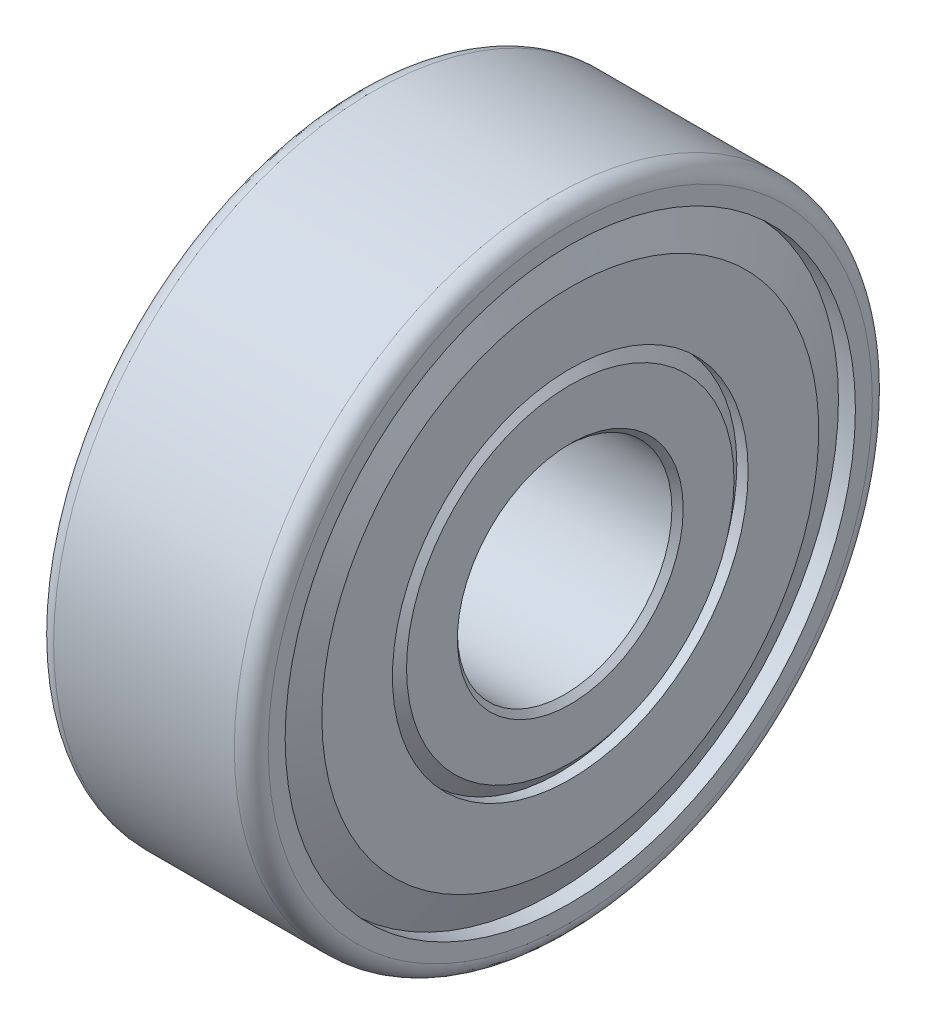
ISO-10303-21;
HEADER;
FILE_DESCRIPTION(('STEP AP214'),'2;1');
FILE_NAME('part.step','',(''),(''),'','','');
FILE_SCHEMA(('AUTOMOTIVE_DESIGN { 1 0 10303 214 1 1 1 1 }'));
ENDSEC;
DATA;
#1=APPLICATION_CONTEXT('core data for automotive mechanical design processes');
#2=APPLICATION_PROTOCOL_DEFINITION('international standard','automotive_design',2000,#1);
#3=PRODUCT_CONTEXT('',#1,'mechanical');
#4=PRODUCT('Part','Part','',(#3));
#5=PRODUCT_RELATED_PRODUCT_CATEGORY('part','',(#4));
#6=PRODUCT_DEFINITION_FORMATION('','',#4);
#7=PRODUCT_DEFINITION_CONTEXT('part definition',#1,'design');
#8=PRODUCT_DEFINITION('design','',#6,#7);
#9=PRODUCT_DEFINITION_SHAPE('','',#8);
#10=(LENGTH_UNIT() NAMED_UNIT(*) SI_UNIT(.MILLI.,.METRE.));
#11=(NAMED_UNIT(*) PLANE_ANGLE_UNIT() SI_UNIT($,.RADIAN.));
#12=(NAMED_UNIT(*) SI_UNIT($,.STERADIAN.) SOLID_ANGLE_UNIT());
#13=UNCERTAINTY_MEASURE_WITH_UNIT(LENGTH_MEASURE(1.E-05),#10,'distance_accuracy_value','');
#14=(GEOMETRIC_REPRESENTATION_CONTEXT(3) GLOBAL_UNCERTAINTY_ASSIGNED_CONTEXT((#13)) GLOBAL_UNIT_ASSIGNED_CONTEXT((#10,
#11,#12)) REPRESENTATION_CONTEXT('',''));
#15=CARTESIAN_POINT('',(0.,0.,0.));
#16=DIRECTION('',(0.,0.,1.));
#17=DIRECTION('',(1.,0.,0.));
#18=AXIS2_PLACEMENT_3D('',#15,#16,#17);
#19=CARTESIAN_POINT('',(0.,0.,0.));
#20=DIRECTION('',(1.,0.,0.));
#21=DIRECTION('',(0.,0.,-1.));
#22=AXIS2_PLACEMENT_3D('',#19,#20,#21);
#23=CYLINDRICAL_SURFACE('',#22,4.826);
#24=CARTESIAN_POINT('',(9.39799999997604,0.,0.));
#25=DIRECTION('',(1.,0.,0.));
#26=DIRECTION('',(0.,0.,-1.));
#27=AXIS2_PLACEMENT_3D('',#24,#25,#26);
#28=CIRCLE('',#27,4.82599999998001);
#29=CARTESIAN_POINT('',(9.39799999997604,0.,-4.82599999998001));
#30=VERTEX_POINT('',#29);
#31=EDGE_CURVE('E330',#30,#30,#28,.T.);
#32=ORIENTED_EDGE('',*,*,#31,.T.);
#33=EDGE_LOOP('',(#32));
#34=FACE_BOUND('',#33,.T.);
#35=CARTESIAN_POINT('',(0.254000000040833,0.,0.));
#36=DIRECTION('',(-1.,0.,0.));
#37=DIRECTION('',(0.,0.,1.));
#38=AXIS2_PLACEMENT_3D('',#35,#36,#37);
#39=CIRCLE('',#38,4.82599999998001);
#40=CARTESIAN_POINT('',(0.254000000040833,0.,4.82599999998001));
#41=VERTEX_POINT('',#40);
#42=EDGE_CURVE('E360',#41,#41,#39,.T.);
#43=ORIENTED_EDGE('',*,*,#42,.T.);
#44=EDGE_LOOP('',(#43));
#45=FACE_BOUND('',#44,.T.);
#46=ADVANCED_FACE('F17',(#34,#45),#23,.F.);
#47=CARTESIAN_POINT('',(9.65199999996003,0.,0.));
#48=DIRECTION('',(1.,0.,0.));
#49=DIRECTION('',(0.,0.,-1.));
#50=AXIS2_PLACEMENT_3D('',#47,#48,#49);
#51=CONICAL_SURFACE('',#50,5.079999999964,0.785398163397448);
#52=ORIENTED_EDGE('',*,*,#31,.F.);
#53=EDGE_LOOP('',(#52));
#54=FACE_BOUND('',#53,.T.);
#55=CARTESIAN_POINT('',(9.65199999996003,0.,0.));
#56=DIRECTION('',(1.,0.,0.));
#57=DIRECTION('',(0.,0.,-1.));
#58=AXIS2_PLACEMENT_3D('',#55,#56,#57);
#59=CIRCLE('',#58,5.079999999964);
#60=CARTESIAN_POINT('',(9.65199999996003,0.,-5.079999999964));
#61=VERTEX_POINT('',#60);
#62=EDGE_CURVE('E357',#61,#61,#59,.F.);
#63=ORIENTED_EDGE('',*,*,#62,.F.);
#64=EDGE_LOOP('',(#63));
#65=FACE_BOUND('',#64,.T.);
#66=ADVANCED_FACE('F175',(#54,#65),#51,.F.);
#67=CARTESIAN_POINT('',(0.,0.,0.));
#68=DIRECTION('',(-1.,0.,0.));
#69=DIRECTION('',(0.,0.,1.));
#70=AXIS2_PLACEMENT_3D('',#67,#68,#69);
#71=CONICAL_SURFACE('',#70,5.08000000007769,0.785398163509345);
#72=CARTESIAN_POINT('',(0.,0.,0.));
#73=DIRECTION('',(-1.,0.,0.));
#74=DIRECTION('',(0.,0.,1.));
#75=AXIS2_PLACEMENT_3D('',#72,#73,#74);
#76=CIRCLE('',#75,5.08000000007769);
#77=CARTESIAN_POINT('',(0.,0.,5.08000000007769));
#78=VERTEX_POINT('',#77);
#79=EDGE_CURVE('E354',#78,#78,#76,.T.);
#80=ORIENTED_EDGE('',*,*,#79,.T.);
#81=EDGE_LOOP('',(#80));
#82=FACE_BOUND('',#81,.T.);
#83=ORIENTED_EDGE('',*,*,#42,.F.);
#84=EDGE_LOOP('',(#83));
#85=FACE_BOUND('',#84,.T.);
#86=ADVANCED_FACE('F172',(#82,#85),#71,.F.);
#87=CARTESIAN_POINT('',(9.652,0.,0.));
#88=DIRECTION('',(1.,0.,0.));
#89=DIRECTION('',(0.,0.,-1.));
#90=AXIS2_PLACEMENT_3D('',#87,#88,#89);
#91=PLANE('',#90);
#92=CARTESIAN_POINT('',(9.652,0.,0.));
#93=DIRECTION('',(-1.,0.,0.));
#94=DIRECTION('',(0.,0.,1.));
#95=AXIS2_PLACEMENT_3D('',#92,#93,#94);
#96=CIRCLE('',#95,7.366);
#97=CARTESIAN_POINT('',(9.652,0.,7.366));
#98=VERTEX_POINT('',#97);
#99=EDGE_CURVE('E351',#98,#98,#96,.T.);
#100=ORIENTED_EDGE('',*,*,#99,.F.);
#101=EDGE_LOOP('',(#100));
#102=FACE_BOUND('',#101,.T.);
#103=ORIENTED_EDGE('',*,*,#62,.T.);
#104=EDGE_LOOP('',(#103));
#105=FACE_BOUND('',#104,.T.);
#106=ADVANCED_FACE('F168',(#102,#105),#91,.T.);
#107=CARTESIAN_POINT('',(0.,0.,0.));
#108=DIRECTION('',(1.,0.,0.));
#109=DIRECTION('',(0.,0.,-1.));
#110=AXIS2_PLACEMENT_3D('',#107,#108,#109);
#111=PLANE('',#110);
#112=CARTESIAN_POINT('',(0.,0.,0.));
#113=DIRECTION('',(1.,0.,0.));
#114=DIRECTION('',(0.,0.,-1.));
#115=AXIS2_PLACEMENT_3D('',#112,#113,#114);
#116=CIRCLE('',#115,7.366);
#117=CARTESIAN_POINT('',(0.,0.,-7.366));
#118=VERTEX_POINT('',#117);
#119=EDGE_CURVE('E347',#118,#118,#116,.T.);
#120=ORIENTED_EDGE('',*,*,#119,.F.);
#121=EDGE_LOOP('',(#120));
#122=FACE_BOUND('',#121,.T.);
#123=ORIENTED_EDGE('',*,*,#79,.F.);
#124=EDGE_LOOP('',(#123));
#125=FACE_BOUND('',#124,.T.);
#126=ADVANCED_FACE('F164',(#122,#125),#111,.F.);
#127=CARTESIAN_POINT('',(9.144,0.,0.));
#128=DIRECTION('',(-1.,0.,0.));
#129=DIRECTION('',(0.,0.,1.));
#130=AXIS2_PLACEMENT_3D('',#127,#128,#129);
#131=CONICAL_SURFACE('',#130,8.001,0.896055384571346);
#132=ORIENTED_EDGE('',*,*,#99,.T.);
#133=EDGE_LOOP('',(#132));
#134=FACE_BOUND('',#133,.T.);
#135=CARTESIAN_POINT('',(9.144,0.,0.));
#136=DIRECTION('',(1.,0.,0.));
#137=DIRECTION('',(0.,0.,-1.));
#138=AXIS2_PLACEMENT_3D('',#135,#136,#137);
#139=CIRCLE('',#138,8.001);
#140=CARTESIAN_POINT('',(9.144,0.,-8.001));
#141=VERTEX_POINT('',#140);
#142=EDGE_CURVE('E350',#141,#141,#139,.T.);
#143=ORIENTED_EDGE('',*,*,#142,.T.);
#144=EDGE_LOOP('',(#143));
#145=FACE_BOUND('',#144,.T.);
#146=ADVANCED_FACE('F160',(#134,#145),#131,.T.);
#147=CARTESIAN_POINT('',(0.507999999999999,0.,0.));
#148=DIRECTION('',(1.,0.,0.));
#149=DIRECTION('',(0.,0.,-1.));
#150=AXIS2_PLACEMENT_3D('',#147,#148,#149);
#151=CONICAL_SURFACE('',#150,8.001,0.896055384571345);
#152=ORIENTED_EDGE('',*,*,#119,.T.);
#153=EDGE_LOOP('',(#152));
#154=FACE_BOUND('',#153,.T.);
#155=CARTESIAN_POINT('',(0.508,0.,0.));
#156=DIRECTION('',(-1.,0.,0.));
#157=DIRECTION('',(0.,0.,1.));
#158=AXIS2_PLACEMENT_3D('',#155,#156,#157);
#159=CIRCLE('',#158,8.001);
#160=CARTESIAN_POINT('',(0.508,0.,8.001));
#161=VERTEX_POINT('',#160);
#162=EDGE_CURVE('E346',#161,#161,#159,.T.);
#163=ORIENTED_EDGE('',*,*,#162,.T.);
#164=EDGE_LOOP('',(#163));
#165=FACE_BOUND('',#164,.T.);
#166=ADVANCED_FACE('F156',(#154,#165),#151,.T.);
#167=CARTESIAN_POINT('',(9.144,0.,0.));
#168=DIRECTION('',(1.,0.,0.));
#169=DIRECTION('',(0.,0.,-1.));
#170=AXIS2_PLACEMENT_3D('',#167,#168,#169);
#171=CYLINDRICAL_SURFACE('',#170,8.001);
#172=CARTESIAN_POINT('',(9.652,0.,0.));
#173=DIRECTION('',(1.,0.,0.));
#174=DIRECTION('',(0.,0.,-1.));
#175=AXIS2_PLACEMENT_3D('',#172,#173,#174);
#176=CIRCLE('',#175,8.001);
#177=CARTESIAN_POINT('',(9.652,0.,-8.001));
#178=VERTEX_POINT('',#177);
#179=EDGE_CURVE('E343',#178,#178,#176,.F.);
#180=ORIENTED_EDGE('',*,*,#179,.F.);
#181=EDGE_LOOP('',(#180));
#182=FACE_BOUND('',#181,.T.);
#183=ORIENTED_EDGE('',*,*,#142,.F.);
#184=EDGE_LOOP('',(#183));
#185=FACE_BOUND('',#184,.T.);
#186=ADVANCED_FACE('F152',(#182,#185),#171,.F.);
#187=CARTESIAN_POINT('',(0.508,0.,0.));
#188=DIRECTION('',(-1.,0.,0.));
#189=DIRECTION('',(0.,0.,1.));
#190=AXIS2_PLACEMENT_3D('',#187,#188,#189);
#191=CYLINDRICAL_SURFACE('',#190,8.001);
#192=CARTESIAN_POINT('',(0.,0.,0.));
#193=DIRECTION('',(-1.,0.,0.));
#194=DIRECTION('',(0.,0.,1.));
#195=AXIS2_PLACEMENT_3D('',#192,#193,#194);
#196=CIRCLE('',#195,8.001);
#197=CARTESIAN_POINT('',(0.,0.,8.001));
#198=VERTEX_POINT('',#197);
#199=EDGE_CURVE('E340',#198,#198,#196,.T.);
#200=ORIENTED_EDGE('',*,*,#199,.T.);
#201=EDGE_LOOP('',(#200));
#202=FACE_BOUND('',#201,.T.);
#203=ORIENTED_EDGE('',*,*,#162,.F.);
#204=EDGE_LOOP('',(#203));
#205=FACE_BOUND('',#204,.T.);
#206=ADVANCED_FACE('F148',(#202,#205),#191,.F.);
#207=CARTESIAN_POINT('',(9.652,0.,0.));
#208=DIRECTION('',(1.,0.,0.));
#209=DIRECTION('',(0.,0.,-1.));
#210=AXIS2_PLACEMENT_3D('',#207,#208,#209);
#211=PLANE('',#210);
#212=CARTESIAN_POINT('',(9.652,0.,0.));
#213=DIRECTION('',(-1.,0.,0.));
#214=DIRECTION('',(0.,0.,1.));
#215=AXIS2_PLACEMENT_3D('',#212,#213,#214);
#216=CIRCLE('',#215,11.176);
#217=CARTESIAN_POINT('',(9.652,0.,11.176));
#218=VERTEX_POINT('',#217);
#219=EDGE_CURVE('E337',#218,#218,#216,.T.);
#220=ORIENTED_EDGE('',*,*,#219,.F.);
#221=EDGE_LOOP('',(#220));
#222=FACE_BOUND('',#221,.T.);
#223=ORIENTED_EDGE('',*,*,#179,.T.);
#224=EDGE_LOOP('',(#223));
#225=FACE_BOUND('',#224,.T.);
#226=ADVANCED_FACE('F144',(#222,#225),#211,.T.);
#227=CARTESIAN_POINT('',(0.,0.,0.));
#228=DIRECTION('',(1.,0.,0.));
#229=DIRECTION('',(0.,0.,-1.));
#230=AXIS2_PLACEMENT_3D('',#227,#228,#229);
#231=PLANE('',#230);
#232=ORIENTED_EDGE('',*,*,#199,.F.);
#233=EDGE_LOOP('',(#232));
#234=FACE_BOUND('',#233,.T.);
#235=CARTESIAN_POINT('',(0.,0.,0.));
#236=DIRECTION('',(1.,0.,0.));
#237=DIRECTION('',(0.,0.,-1.));
#238=AXIS2_PLACEMENT_3D('',#235,#236,#237);
#239=CIRCLE('',#238,11.176);
#240=CARTESIAN_POINT('',(0.,0.,-11.176));
#241=VERTEX_POINT('',#240);
#242=EDGE_CURVE('E333',#241,#241,#239,.T.);
#243=ORIENTED_EDGE('',*,*,#242,.F.);
#244=EDGE_LOOP('',(#243));
#245=FACE_BOUND('',#244,.T.);
#246=ADVANCED_FACE('F140',(#234,#245),#231,.F.);
#247=CARTESIAN_POINT('',(8.89,0.,0.));
#248=DIRECTION('',(-1.,0.,0.));
#249=DIRECTION('',(0.,0.,1.));
#250=AXIS2_PLACEMENT_3D('',#247,#248,#249);
#251=CONICAL_SURFACE('',#250,12.827,1.13838855122436);
#252=ORIENTED_EDGE('',*,*,#219,.T.);
#253=EDGE_LOOP('',(#252));
#254=FACE_BOUND('',#253,.T.);
#255=CARTESIAN_POINT('',(8.89,0.,0.));
#256=DIRECTION('',(1.,0.,0.));
#257=DIRECTION('',(0.,0.,-1.));
#258=AXIS2_PLACEMENT_3D('',#255,#256,#257);
#259=CIRCLE('',#258,12.827);
#260=CARTESIAN_POINT('',(8.89,0.,-12.827));
#261=VERTEX_POINT('',#260);
#262=EDGE_CURVE('E336',#261,#261,#259,.T.);
#263=ORIENTED_EDGE('',*,*,#262,.T.);
#264=EDGE_LOOP('',(#263));
#265=FACE_BOUND('',#264,.T.);
#266=ADVANCED_FACE('F136',(#254,#265),#251,.T.);
#267=CARTESIAN_POINT('',(0.762000000000002,0.,0.));
#268=DIRECTION('',(1.,0.,0.));
#269=DIRECTION('',(0.,0.,-1.));
#270=AXIS2_PLACEMENT_3D('',#267,#268,#269);
#271=CONICAL_SURFACE('',#270,12.827,1.13838855122436);
#272=ORIENTED_EDGE('',*,*,#242,.T.);
#273=EDGE_LOOP('',(#272));
#274=FACE_BOUND('',#273,.T.);
#275=CARTESIAN_POINT('',(0.762,0.,0.));
#276=DIRECTION('',(-1.,0.,0.));
#277=DIRECTION('',(0.,0.,1.));
#278=AXIS2_PLACEMENT_3D('',#275,#276,#277);
#279=CIRCLE('',#278,12.827);
#280=CARTESIAN_POINT('',(0.762,0.,12.827));
#281=VERTEX_POINT('',#280);
#282=EDGE_CURVE('E327',#281,#281,#279,.T.);
#283=ORIENTED_EDGE('',*,*,#282,.T.);
#284=EDGE_LOOP('',(#283));
#285=FACE_BOUND('',#284,.T.);
#286=ADVANCED_FACE('F132',(#274,#285),#271,.T.);
#287=CARTESIAN_POINT('',(8.89,0.,0.));
#288=DIRECTION('',(1.,0.,0.));
#289=DIRECTION('',(0.,0.,-1.));
#290=AXIS2_PLACEMENT_3D('',#287,#288,#289);
#291=CYLINDRICAL_SURFACE('',#290,12.827);
#292=CARTESIAN_POINT('',(9.652,0.,0.));
#293=DIRECTION('',(1.,0.,0.));
#294=DIRECTION('',(0.,0.,-1.));
#295=AXIS2_PLACEMENT_3D('',#292,#293,#294);
#296=CIRCLE('',#295,12.827);
#297=CARTESIAN_POINT('',(9.652,0.,-12.827));
#298=VERTEX_POINT('',#297);
#299=EDGE_CURVE('E324',#298,#298,#296,.F.);
#300=ORIENTED_EDGE('',*,*,#299,.F.);
#301=EDGE_LOOP('',(#300));
#302=FACE_BOUND('',#301,.T.);
#303=ORIENTED_EDGE('',*,*,#262,.F.);
#304=EDGE_LOOP('',(#303));
#305=FACE_BOUND('',#304,.T.);
#306=ADVANCED_FACE('F128',(#302,#305),#291,.F.);
#307=CARTESIAN_POINT('',(0.762,0.,0.));
#308=DIRECTION('',(-1.,0.,0.));
#309=DIRECTION('',(0.,0.,1.));
#310=AXIS2_PLACEMENT_3D('',#307,#308,#309);
#311=CYLINDRICAL_SURFACE('',#310,12.827);
#312=CARTESIAN_POINT('',(0.,0.,0.));
#313=DIRECTION('',(-1.,0.,0.));
#314=DIRECTION('',(0.,0.,1.));
#315=AXIS2_PLACEMENT_3D('',#312,#313,#314);
#316=CIRCLE('',#315,12.827);
#317=CARTESIAN_POINT('',(0.,0.,12.827));
#318=VERTEX_POINT('',#317);
#319=EDGE_CURVE('E53',#318,#318,#316,.T.);
#320=ORIENTED_EDGE('',*,*,#319,.T.);
#321=EDGE_LOOP('',(#320));
#322=FACE_BOUND('',#321,.T.);
#323=ORIENTED_EDGE('',*,*,#282,.F.);
#324=EDGE_LOOP('',(#323));
#325=FACE_BOUND('',#324,.T.);
#326=ADVANCED_FACE('F124',(#322,#325),#311,.F.);
#327=CARTESIAN_POINT('',(9.652,0.,0.));
#328=DIRECTION('',(1.,0.,0.));
#329=DIRECTION('',(0.,0.,-1.));
#330=AXIS2_PLACEMENT_3D('',#327,#328,#329);
#331=PLANE('',#330);
#332=CARTESIAN_POINT('',(9.652,0.,0.));
#333=DIRECTION('',(-1.,0.,0.));
#334=DIRECTION('',(0.,0.,1.));
#335=AXIS2_PLACEMENT_3D('',#332,#333,#334);
#336=CIRCLE('',#335,13.589);
#337=CARTESIAN_POINT('',(9.652,0.,13.589));
#338=VERTEX_POINT('',#337);
#339=CARTESIAN_POINT('',(9.652,0.,-13.589));
#340=VERTEX_POINT('',#339);
#341=EDGE_CURVE('E51',#338,#340,#336,.T.);
#342=ORIENTED_EDGE('',*,*,#341,.F.);
#343=CARTESIAN_POINT('',(9.652,0.,0.));
#344=DIRECTION('',(-1.,0.,0.));
#345=DIRECTION('',(0.,0.,-1.));
#346=AXIS2_PLACEMENT_3D('',#343,#344,#345);
#347=CIRCLE('',#346,13.589);
#348=EDGE_CURVE('E45',#340,#338,#347,.T.);
#349=ORIENTED_EDGE('',*,*,#348,.F.);
#350=EDGE_LOOP('',(#342,#349));
#351=FACE_BOUND('',#350,.T.);
#352=ORIENTED_EDGE('',*,*,#299,.T.);
#353=EDGE_LOOP('',(#352));
#354=FACE_BOUND('',#353,.T.);
#355=ADVANCED_FACE('F49',(#351,#354),#331,.T.);
#356=CARTESIAN_POINT('',(0.,0.,0.));
#357=DIRECTION('',(1.,0.,0.));
#358=DIRECTION('',(0.,0.,-1.));
#359=AXIS2_PLACEMENT_3D('',#356,#357,#358);
#360=PLANE('',#359);
#361=ORIENTED_EDGE('',*,*,#319,.F.);
#362=EDGE_LOOP('',(#361));
#363=FACE_BOUND('',#362,.T.);
#364=CARTESIAN_POINT('',(0.,0.,0.));
#365=DIRECTION('',(1.,0.,0.));
#366=DIRECTION('',(0.,0.,-1.));
#367=AXIS2_PLACEMENT_3D('',#364,#365,#366);
#368=CIRCLE('',#367,13.589);
#369=CARTESIAN_POINT('',(0.,0.,-13.589));
#370=VERTEX_POINT('',#369);
#371=CARTESIAN_POINT('',(0.,0.,13.589));
#372=VERTEX_POINT('',#371);
#373=EDGE_CURVE('E59',#370,#372,#368,.T.);
#374=ORIENTED_EDGE('',*,*,#373,.F.);
#375=CARTESIAN_POINT('',(0.,0.,0.));
#376=DIRECTION('',(1.,0.,0.));
#377=DIRECTION('',(0.,0.,1.));
#378=AXIS2_PLACEMENT_3D('',#375,#376,#377);
#379=CIRCLE('',#378,13.589);
#380=EDGE_CURVE('E36',#372,#370,#379,.T.);
#381=ORIENTED_EDGE('',*,*,#380,.F.);
#382=EDGE_LOOP('',(#374,#381));
#383=FACE_BOUND('',#382,.T.);
#384=ADVANCED_FACE('F79',(#363,#383),#360,.F.);
#385=CARTESIAN_POINT('',(8.89,0.,0.));
#386=DIRECTION('',(1.,0.,0.));
#387=DIRECTION('',(0.,0.,-1.));
#388=AXIS2_PLACEMENT_3D('',#385,#386,#387);
#389=TOROIDAL_SURFACE('',#388,13.589,0.762);
#390=ORIENTED_EDGE('',*,*,#348,.T.);
#391=ORIENTED_EDGE('',*,*,#341,.T.);
#392=EDGE_LOOP('',(#390,#391));
#393=FACE_BOUND('',#392,.T.);
#394=CARTESIAN_POINT('',(8.89,0.,0.));
#395=DIRECTION('',(-1.,0.,0.));
#396=DIRECTION('',(0.,0.,1.));
#397=AXIS2_PLACEMENT_3D('',#394,#395,#396);
#398=CIRCLE('',#397,14.351);
#399=CARTESIAN_POINT('',(8.89,0.,14.351));
#400=VERTEX_POINT('',#399);
#401=EDGE_CURVE('E28',#400,#400,#398,.T.);
#402=ORIENTED_EDGE('',*,*,#401,.F.);
#403=EDGE_LOOP('',(#402));
#404=FACE_BOUND('',#403,.T.);
#405=ADVANCED_FACE('F57',(#393,#404),#389,.T.);
#406=CARTESIAN_POINT('',(0.762000000000001,0.,0.));
#407=DIRECTION('',(1.,0.,0.));
#408=DIRECTION('',(0.,0.,-1.));
#409=AXIS2_PLACEMENT_3D('',#406,#407,#408);
#410=TOROIDAL_SURFACE('',#409,13.589,0.762);
#411=CARTESIAN_POINT('',(0.762000000000001,0.,0.));
#412=DIRECTION('',(-1.,0.,0.));
#413=DIRECTION('',(0.,0.,1.));
#414=AXIS2_PLACEMENT_3D('',#411,#412,#413);
#415=CIRCLE('',#414,14.351);
#416=CARTESIAN_POINT('',(0.762000000000001,0.,14.351));
#417=VERTEX_POINT('',#416);
#418=EDGE_CURVE('E11',#417,#417,#415,.F.);
#419=ORIENTED_EDGE('',*,*,#418,.F.);
#420=EDGE_LOOP('',(#419));
#421=FACE_BOUND('',#420,.T.);
#422=ORIENTED_EDGE('',*,*,#373,.T.);
#423=ORIENTED_EDGE('',*,*,#380,.T.);
#424=EDGE_LOOP('',(#422,#423));
#425=FACE_BOUND('',#424,.T.);
#426=ADVANCED_FACE('F78',(#421,#425),#410,.T.);
#427=CARTESIAN_POINT('',(9.652,0.,0.));
#428=DIRECTION('',(-1.,0.,0.));
#429=DIRECTION('',(0.,0.,1.));
#430=AXIS2_PLACEMENT_3D('',#427,#428,#429);
#431=CYLINDRICAL_SURFACE('',#430,14.351);
#432=ORIENTED_EDGE('',*,*,#418,.T.);
#433=EDGE_LOOP('',(#432));
#434=FACE_BOUND('',#433,.T.);
#435=ORIENTED_EDGE('',*,*,#401,.T.);
#436=EDGE_LOOP('',(#435));
#437=FACE_BOUND('',#436,.T.);
#438=ADVANCED_FACE('F186',(#434,#437),#431,.T.);
#439=CLOSED_SHELL('',(#46,#66,#86,#106,#126,#146,#166,#186,#206,#226,#246,#266,#286,#306,#326,
#355,#384,#405,#426,#438));
#440=MANIFOLD_SOLID_BREP('B1',#439);
#441=ADVANCED_BREP_SHAPE_REPRESENTATION('',(#18,#440),#14);
#442=SHAPE_DEFINITION_REPRESENTATION(#9,#441);
ENDSEC;
END-ISO-10303-21;
